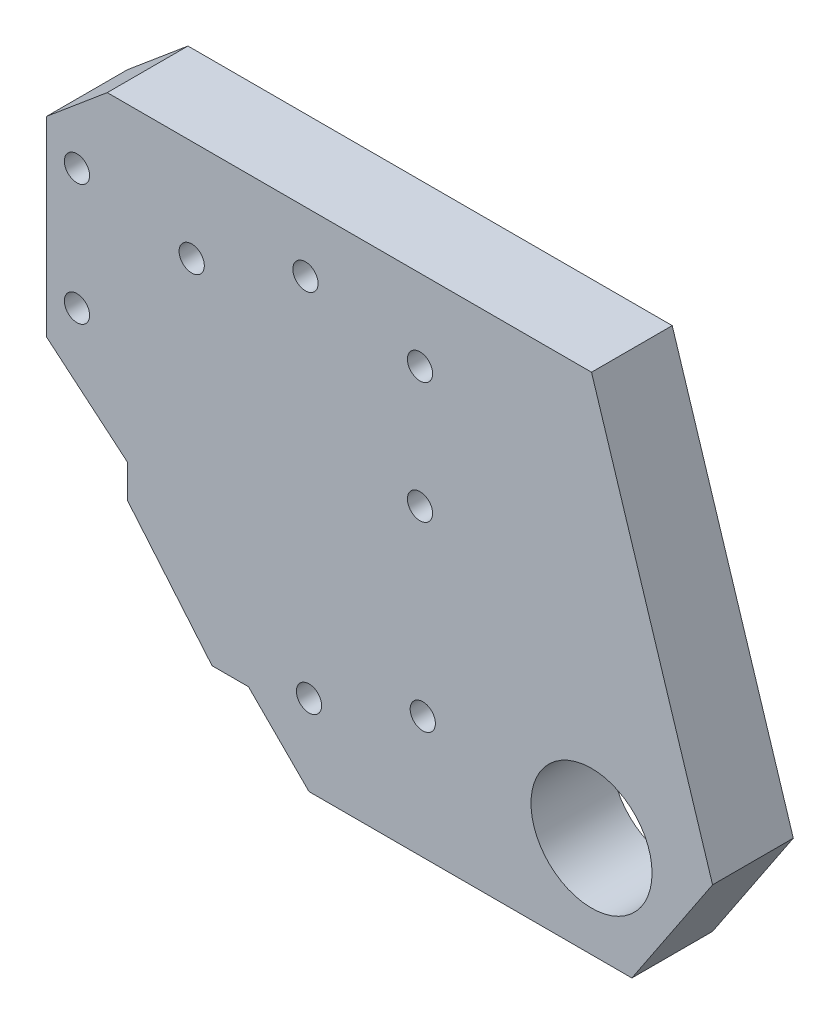
ISO-10303-21;
HEADER;
FILE_DESCRIPTION(('STEP AP214'),'2;1');
FILE_NAME('part.step','',(''),(''),'','','');
FILE_SCHEMA(('AUTOMOTIVE_DESIGN { 1 0 10303 214 1 1 1 1 }'));
ENDSEC;
DATA;
#1=APPLICATION_CONTEXT('core data for automotive mechanical design processes');
#2=APPLICATION_PROTOCOL_DEFINITION('international standard','automotive_design',2000,#1);
#3=PRODUCT_CONTEXT('',#1,'mechanical');
#4=PRODUCT('Part','Part','',(#3));
#5=PRODUCT_RELATED_PRODUCT_CATEGORY('part','',(#4));
#6=PRODUCT_DEFINITION_FORMATION('','',#4);
#7=PRODUCT_DEFINITION_CONTEXT('part definition',#1,'design');
#8=PRODUCT_DEFINITION('design','',#6,#7);
#9=PRODUCT_DEFINITION_SHAPE('','',#8);
#10=(LENGTH_UNIT() NAMED_UNIT(*) SI_UNIT(.MILLI.,.METRE.));
#11=(NAMED_UNIT(*) PLANE_ANGLE_UNIT() SI_UNIT($,.RADIAN.));
#12=(NAMED_UNIT(*) SI_UNIT($,.STERADIAN.) SOLID_ANGLE_UNIT());
#13=UNCERTAINTY_MEASURE_WITH_UNIT(LENGTH_MEASURE(1.E-05),#10,'distance_accuracy_value','');
#14=(GEOMETRIC_REPRESENTATION_CONTEXT(3) GLOBAL_UNCERTAINTY_ASSIGNED_CONTEXT((#13)) GLOBAL_UNIT_ASSIGNED_CONTEXT((#10,
#11,#12)) REPRESENTATION_CONTEXT('',''));
#15=CARTESIAN_POINT('',(0.,0.,0.));
#16=DIRECTION('',(0.,0.,1.));
#17=DIRECTION('',(1.,0.,0.));
#18=AXIS2_PLACEMENT_3D('',#15,#16,#17);
#19=CARTESIAN_POINT('',(0.,0.,4.));
#20=DIRECTION('',(0.,0.,1.));
#21=DIRECTION('',(1.,0.,0.));
#22=AXIS2_PLACEMENT_3D('',#19,#20,#21);
#23=PLANE('',#22);
#24=CARTESIAN_POINT('',(8.82381328817901,22.0268954133145,4.));
#25=DIRECTION('',(0.,0.,1.));
#26=DIRECTION('',(1.,0.,0.));
#27=AXIS2_PLACEMENT_3D('',#24,#25,#26);
#28=CIRCLE('',#27,0.624999999999999);
#29=CARTESIAN_POINT('',(9.44881328817901,22.0268954133145,4.));
#30=VERTEX_POINT('',#29);
#31=EDGE_CURVE('E169',#30,#30,#28,.T.);
#32=ORIENTED_EDGE('',*,*,#31,.F.);
#33=EDGE_LOOP('',(#32));
#34=FACE_BOUND('',#33,.T.);
#35=CARTESIAN_POINT('',(14.6381557247154,6.05212085995405,4.));
#36=DIRECTION('',(0.,0.,1.));
#37=DIRECTION('',(1.,0.,0.));
#38=AXIS2_PLACEMENT_3D('',#35,#36,#37);
#39=CIRCLE('',#38,0.624999999999999);
#40=CARTESIAN_POINT('',(15.2631557247154,6.05212085995405,4.));
#41=VERTEX_POINT('',#40);
#42=EDGE_CURVE('E168',#41,#41,#39,.T.);
#43=ORIENTED_EDGE('',*,*,#42,.F.);
#44=EDGE_LOOP('',(#43));
#45=FACE_BOUND('',#44,.T.);
#46=CARTESIAN_POINT('',(9.,4.,4.));
#47=DIRECTION('',(0.,0.,1.));
#48=DIRECTION('',(1.,0.,0.));
#49=AXIS2_PLACEMENT_3D('',#46,#47,#48);
#50=CIRCLE('',#49,0.624999999999999);
#51=CARTESIAN_POINT('',(9.625,4.,4.));
#52=VERTEX_POINT('',#51);
#53=EDGE_CURVE('E173',#52,#52,#50,.T.);
#54=ORIENTED_EDGE('',*,*,#53,.F.);
#55=EDGE_LOOP('',(#54));
#56=FACE_BOUND('',#55,.T.);
#57=CARTESIAN_POINT('',(3.18565756346356,19.9747745533604,4.));
#58=DIRECTION('',(0.,0.,1.));
#59=DIRECTION('',(1.,0.,0.));
#60=AXIS2_PLACEMENT_3D('',#57,#58,#59);
#61=CIRCLE('',#60,0.624999999999998);
#62=CARTESIAN_POINT('',(3.81065756346356,19.9747745533604,4.));
#63=VERTEX_POINT('',#62);
#64=EDGE_CURVE('E177',#63,#63,#61,.T.);
#65=ORIENTED_EDGE('',*,*,#64,.F.);
#66=EDGE_LOOP('',(#65));
#67=FACE_BOUND('',#66,.T.);
#68=CARTESIAN_POINT('',(-2.5,21.,4.));
#69=DIRECTION('',(0.,0.,1.));
#70=DIRECTION('',(1.,0.,0.));
#71=AXIS2_PLACEMENT_3D('',#68,#69,#70);
#72=CIRCLE('',#71,0.624999999999998);
#73=CARTESIAN_POINT('',(-1.875,21.,4.));
#74=VERTEX_POINT('',#73);
#75=EDGE_CURVE('E181',#74,#74,#72,.T.);
#76=ORIENTED_EDGE('',*,*,#75,.F.);
#77=EDGE_LOOP('',(#76));
#78=FACE_BOUND('',#77,.T.);
#79=CARTESIAN_POINT('',(14.5,21.,4.));
#80=DIRECTION('',(0.,0.,1.));
#81=DIRECTION('',(1.,0.,0.));
#82=AXIS2_PLACEMENT_3D('',#79,#80,#81);
#83=CIRCLE('',#82,0.624999999999999);
#84=CARTESIAN_POINT('',(15.125,21.,4.));
#85=VERTEX_POINT('',#84);
#86=EDGE_CURVE('E185',#85,#85,#83,.T.);
#87=ORIENTED_EDGE('',*,*,#86,.F.);
#88=EDGE_LOOP('',(#87));
#89=FACE_BOUND('',#88,.T.);
#90=CARTESIAN_POINT('',(14.5,15.,4.));
#91=DIRECTION('',(0.,0.,1.));
#92=DIRECTION('',(1.,0.,0.));
#93=AXIS2_PLACEMENT_3D('',#90,#91,#92);
#94=CIRCLE('',#93,0.624999999999999);
#95=CARTESIAN_POINT('',(15.125,15.,4.));
#96=VERTEX_POINT('',#95);
#97=EDGE_CURVE('E189',#96,#96,#94,.T.);
#98=ORIENTED_EDGE('',*,*,#97,.F.);
#99=EDGE_LOOP('',(#98));
#100=FACE_BOUND('',#99,.T.);
#101=CARTESIAN_POINT('',(-2.5,15.,4.));
#102=DIRECTION('',(0.,0.,1.));
#103=DIRECTION('',(1.,0.,0.));
#104=AXIS2_PLACEMENT_3D('',#101,#102,#103);
#105=CIRCLE('',#104,0.624999999999998);
#106=CARTESIAN_POINT('',(-1.875,15.,4.));
#107=VERTEX_POINT('',#106);
#108=EDGE_CURVE('E193',#107,#107,#105,.T.);
#109=ORIENTED_EDGE('',*,*,#108,.F.);
#110=EDGE_LOOP('',(#109));
#111=FACE_BOUND('',#110,.T.);
#112=DIRECTION('',(-1.,0.,0.));
#113=VECTOR('',#112,1.);
#114=CARTESIAN_POINT('',(23.,25.,4.));
#115=LINE('',#114,#113);
#116=CARTESIAN_POINT('',(23.,25.,4.));
#117=VERTEX_POINT('',#116);
#118=CARTESIAN_POINT('',(-0.999999999999973,25.,4.));
#119=VERTEX_POINT('',#118);
#120=EDGE_CURVE('E132',#117,#119,#115,.T.);
#121=ORIENTED_EDGE('',*,*,#120,.T.);
#122=DIRECTION('',(0.76604444311898,0.642787609686537,0.));
#123=VECTOR('',#122,1.);
#124=CARTESIAN_POINT('',(-12.7232728238191,15.1630060973428,4.));
#125=LINE('',#124,#123);
#126=CARTESIAN_POINT('',(-4.,22.4827011064681,4.));
#127=VERTEX_POINT('',#126);
#128=EDGE_CURVE('E11',#119,#127,#125,.F.);
#129=ORIENTED_EDGE('',*,*,#128,.T.);
#130=DIRECTION('',(0.,-1.,0.));
#131=VECTOR('',#130,1.);
#132=CARTESIAN_POINT('',(-4.,25.,4.));
#133=LINE('',#132,#131);
#134=CARTESIAN_POINT('',(-4.,13.,4.));
#135=VERTEX_POINT('',#134);
#136=EDGE_CURVE('E121',#127,#135,#133,.T.);
#137=ORIENTED_EDGE('',*,*,#136,.T.);
#138=DIRECTION('',(-0.766044443118975,0.642787609686543,0.));
#139=VECTOR('',#138,1.);
#140=CARTESIAN_POINT('',(0.,9.64360147529085,4.));
#141=LINE('',#140,#139);
#142=CARTESIAN_POINT('',(0.,9.64360147529085,4.));
#143=VERTEX_POINT('',#142);
#144=EDGE_CURVE('E125',#135,#143,#141,.F.);
#145=ORIENTED_EDGE('',*,*,#144,.T.);
#146=DIRECTION('',(0.,-1.,0.));
#147=VECTOR('',#146,1.);
#148=CARTESIAN_POINT('',(0.,3.,4.));
#149=LINE('',#148,#147);
#150=CARTESIAN_POINT('',(0.,8.00000000000002,4.));
#151=VERTEX_POINT('',#150);
#152=EDGE_CURVE('E131',#143,#151,#149,.T.);
#153=ORIENTED_EDGE('',*,*,#152,.T.);
#154=DIRECTION('',(-0.642787609686538,0.76604444311898,0.));
#155=VECTOR('',#154,1.);
#156=CARTESIAN_POINT('',(3.93923101204884,3.30540728933227,4.));
#157=LINE('',#156,#155);
#158=CARTESIAN_POINT('',(4.1954981558864,3.,4.));
#159=VERTEX_POINT('',#158);
#160=EDGE_CURVE('E155',#151,#159,#157,.F.);
#161=ORIENTED_EDGE('',*,*,#160,.T.);
#162=DIRECTION('',(1.,0.,0.));
#163=VECTOR('',#162,1.);
#164=CARTESIAN_POINT('',(0.,3.,4.));
#165=LINE('',#164,#163);
#166=CARTESIAN_POINT('',(6.,3.,4.));
#167=VERTEX_POINT('',#166);
#168=EDGE_CURVE('E236',#159,#167,#165,.T.);
#169=ORIENTED_EDGE('',*,*,#168,.T.);
#170=DIRECTION('',(0.707106781186556,-0.707106781186539,0.));
#171=VECTOR('',#170,1.);
#172=CARTESIAN_POINT('',(6.,3.,4.));
#173=LINE('',#172,#171);
#174=CARTESIAN_POINT('',(9.00000000000007,0.,4.));
#175=VERTEX_POINT('',#174);
#176=EDGE_CURVE('E234',#167,#175,#173,.T.);
#177=ORIENTED_EDGE('',*,*,#176,.T.);
#178=DIRECTION('',(1.,0.,0.));
#179=VECTOR('',#178,1.);
#180=CARTESIAN_POINT('',(25.,0.,4.));
#181=LINE('',#180,#179);
#182=CARTESIAN_POINT('',(25.,0.,4.));
#183=VERTEX_POINT('',#182);
#184=EDGE_CURVE('E232',#175,#183,#181,.T.);
#185=ORIENTED_EDGE('',*,*,#184,.T.);
#186=DIRECTION('',(0.554700196225229,0.832050294337844,0.));
#187=VECTOR('',#186,1.);
#188=CARTESIAN_POINT('',(29.,6.,4.));
#189=LINE('',#188,#187);
#190=CARTESIAN_POINT('',(29.,6.,4.));
#191=VERTEX_POINT('',#190);
#192=EDGE_CURVE('E230',#183,#191,#189,.T.);
#193=ORIENTED_EDGE('',*,*,#192,.T.);
#194=DIRECTION('',(-0.301131367937098,0.953582665134141,0.));
#195=VECTOR('',#194,1.);
#196=CARTESIAN_POINT('',(23.,25.,4.));
#197=LINE('',#196,#195);
#198=EDGE_CURVE('E212',#191,#117,#197,.T.);
#199=ORIENTED_EDGE('',*,*,#198,.T.);
#200=EDGE_LOOP('',(#121,#129,#137,#145,#153,#161,#169,#177,#185,#193,#199));
#201=FACE_BOUND('',#200,.T.);
#202=CARTESIAN_POINT('',(23.,5.,4.));
#203=DIRECTION('',(0.,0.,1.));
#204=DIRECTION('',(1.,0.,0.));
#205=AXIS2_PLACEMENT_3D('',#202,#203,#204);
#206=CIRCLE('',#205,3.);
#207=CARTESIAN_POINT('',(26.,5.,4.));
#208=VERTEX_POINT('',#207);
#209=EDGE_CURVE('E228',#208,#208,#206,.T.);
#210=ORIENTED_EDGE('',*,*,#209,.F.);
#211=EDGE_LOOP('',(#210));
#212=FACE_BOUND('',#211,.T.);
#213=ADVANCED_FACE('F39',(#34,#45,#56,#67,#78,#89,#100,#111,#201,#212),#23,.T.);
#214=CARTESIAN_POINT('',(0.,0.,0.));
#215=DIRECTION('',(0.,0.,1.));
#216=DIRECTION('',(1.,0.,0.));
#217=AXIS2_PLACEMENT_3D('',#214,#215,#216);
#218=PLANE('',#217);
#219=CARTESIAN_POINT('',(8.82381328817901,22.0268954133145,0.));
#220=DIRECTION('',(0.,0.,1.));
#221=DIRECTION('',(1.,0.,0.));
#222=AXIS2_PLACEMENT_3D('',#219,#220,#221);
#223=CIRCLE('',#222,0.624999999999998);
#224=CARTESIAN_POINT('',(9.44881328817901,22.0268954133145,0.));
#225=VERTEX_POINT('',#224);
#226=EDGE_CURVE('E165',#225,#225,#223,.T.);
#227=ORIENTED_EDGE('',*,*,#226,.T.);
#228=EDGE_LOOP('',(#227));
#229=FACE_BOUND('',#228,.T.);
#230=CARTESIAN_POINT('',(14.6381557247154,6.05212085995405,0.));
#231=DIRECTION('',(0.,0.,1.));
#232=DIRECTION('',(1.,0.,0.));
#233=AXIS2_PLACEMENT_3D('',#230,#231,#232);
#234=CIRCLE('',#233,0.624999999999998);
#235=CARTESIAN_POINT('',(15.2631557247154,6.05212085995405,0.));
#236=VERTEX_POINT('',#235);
#237=EDGE_CURVE('E170',#236,#236,#234,.T.);
#238=ORIENTED_EDGE('',*,*,#237,.T.);
#239=EDGE_LOOP('',(#238));
#240=FACE_BOUND('',#239,.T.);
#241=CARTESIAN_POINT('',(9.,4.,0.));
#242=DIRECTION('',(0.,0.,1.));
#243=DIRECTION('',(1.,0.,0.));
#244=AXIS2_PLACEMENT_3D('',#241,#242,#243);
#245=CIRCLE('',#244,0.624999999999998);
#246=CARTESIAN_POINT('',(9.625,4.,0.));
#247=VERTEX_POINT('',#246);
#248=EDGE_CURVE('E174',#247,#247,#245,.T.);
#249=ORIENTED_EDGE('',*,*,#248,.T.);
#250=EDGE_LOOP('',(#249));
#251=FACE_BOUND('',#250,.T.);
#252=CARTESIAN_POINT('',(3.18565756346356,19.9747745533604,0.));
#253=DIRECTION('',(0.,0.,1.));
#254=DIRECTION('',(1.,0.,0.));
#255=AXIS2_PLACEMENT_3D('',#252,#253,#254);
#256=CIRCLE('',#255,0.624999999999998);
#257=CARTESIAN_POINT('',(3.81065756346356,19.9747745533604,0.));
#258=VERTEX_POINT('',#257);
#259=EDGE_CURVE('E178',#258,#258,#256,.T.);
#260=ORIENTED_EDGE('',*,*,#259,.T.);
#261=EDGE_LOOP('',(#260));
#262=FACE_BOUND('',#261,.T.);
#263=CARTESIAN_POINT('',(-2.5,21.,0.));
#264=DIRECTION('',(0.,0.,1.));
#265=DIRECTION('',(1.,0.,0.));
#266=AXIS2_PLACEMENT_3D('',#263,#264,#265);
#267=CIRCLE('',#266,0.624999999999998);
#268=CARTESIAN_POINT('',(-1.875,21.,0.));
#269=VERTEX_POINT('',#268);
#270=EDGE_CURVE('E182',#269,#269,#267,.T.);
#271=ORIENTED_EDGE('',*,*,#270,.T.);
#272=EDGE_LOOP('',(#271));
#273=FACE_BOUND('',#272,.T.);
#274=CARTESIAN_POINT('',(14.5,21.,0.));
#275=DIRECTION('',(0.,0.,1.));
#276=DIRECTION('',(1.,0.,0.));
#277=AXIS2_PLACEMENT_3D('',#274,#275,#276);
#278=CIRCLE('',#277,0.624999999999998);
#279=CARTESIAN_POINT('',(15.125,21.,0.));
#280=VERTEX_POINT('',#279);
#281=EDGE_CURVE('E186',#280,#280,#278,.T.);
#282=ORIENTED_EDGE('',*,*,#281,.T.);
#283=EDGE_LOOP('',(#282));
#284=FACE_BOUND('',#283,.T.);
#285=CARTESIAN_POINT('',(14.5,15.,0.));
#286=DIRECTION('',(0.,0.,1.));
#287=DIRECTION('',(1.,0.,0.));
#288=AXIS2_PLACEMENT_3D('',#285,#286,#287);
#289=CIRCLE('',#288,0.624999999999998);
#290=CARTESIAN_POINT('',(15.125,15.,0.));
#291=VERTEX_POINT('',#290);
#292=EDGE_CURVE('E190',#291,#291,#289,.T.);
#293=ORIENTED_EDGE('',*,*,#292,.T.);
#294=EDGE_LOOP('',(#293));
#295=FACE_BOUND('',#294,.T.);
#296=CARTESIAN_POINT('',(-2.5,15.,0.));
#297=DIRECTION('',(0.,0.,1.));
#298=DIRECTION('',(1.,0.,0.));
#299=AXIS2_PLACEMENT_3D('',#296,#297,#298);
#300=CIRCLE('',#299,0.624999999999998);
#301=CARTESIAN_POINT('',(-1.875,15.,0.));
#302=VERTEX_POINT('',#301);
#303=EDGE_CURVE('E194',#302,#302,#300,.T.);
#304=ORIENTED_EDGE('',*,*,#303,.T.);
#305=EDGE_LOOP('',(#304));
#306=FACE_BOUND('',#305,.T.);
#307=DIRECTION('',(0.,-1.,0.));
#308=VECTOR('',#307,1.);
#309=CARTESIAN_POINT('',(-4.,25.,0.));
#310=LINE('',#309,#308);
#311=CARTESIAN_POINT('',(-4.,22.4827011064681,0.));
#312=VERTEX_POINT('',#311);
#313=CARTESIAN_POINT('',(-4.,13.,0.));
#314=VERTEX_POINT('',#313);
#315=EDGE_CURVE('E137',#312,#314,#310,.T.);
#316=ORIENTED_EDGE('',*,*,#315,.F.);
#317=DIRECTION('',(-0.76604444311898,-0.642787609686537,0.));
#318=VECTOR('',#317,1.);
#319=CARTESIAN_POINT('',(-4.,22.4827011064681,0.));
#320=LINE('',#319,#318);
#321=CARTESIAN_POINT('',(-0.999999999999977,25.,0.));
#322=VERTEX_POINT('',#321);
#323=EDGE_CURVE('E61',#312,#322,#320,.F.);
#324=ORIENTED_EDGE('',*,*,#323,.T.);
#325=DIRECTION('',(-1.,0.,0.));
#326=VECTOR('',#325,1.);
#327=CARTESIAN_POINT('',(23.,25.,0.));
#328=LINE('',#327,#326);
#329=CARTESIAN_POINT('',(23.,25.,0.));
#330=VERTEX_POINT('',#329);
#331=EDGE_CURVE('E226',#330,#322,#328,.T.);
#332=ORIENTED_EDGE('',*,*,#331,.F.);
#333=DIRECTION('',(-0.301131367937098,0.953582665134141,0.));
#334=VECTOR('',#333,1.);
#335=CARTESIAN_POINT('',(23.,25.,0.));
#336=LINE('',#335,#334);
#337=CARTESIAN_POINT('',(29.,6.,0.));
#338=VERTEX_POINT('',#337);
#339=EDGE_CURVE('E213',#338,#330,#336,.T.);
#340=ORIENTED_EDGE('',*,*,#339,.F.);
#341=DIRECTION('',(0.554700196225229,0.832050294337844,0.));
#342=VECTOR('',#341,1.);
#343=CARTESIAN_POINT('',(29.,6.,0.));
#344=LINE('',#343,#342);
#345=CARTESIAN_POINT('',(25.,0.,0.));
#346=VERTEX_POINT('',#345);
#347=EDGE_CURVE('E215',#346,#338,#344,.T.);
#348=ORIENTED_EDGE('',*,*,#347,.F.);
#349=DIRECTION('',(1.,0.,0.));
#350=VECTOR('',#349,1.);
#351=CARTESIAN_POINT('',(25.,0.,0.));
#352=LINE('',#351,#350);
#353=CARTESIAN_POINT('',(9.00000000000007,0.,0.));
#354=VERTEX_POINT('',#353);
#355=EDGE_CURVE('E217',#354,#346,#352,.T.);
#356=ORIENTED_EDGE('',*,*,#355,.F.);
#357=DIRECTION('',(0.707106781186556,-0.707106781186539,0.));
#358=VECTOR('',#357,1.);
#359=CARTESIAN_POINT('',(6.,3.,0.));
#360=LINE('',#359,#358);
#361=CARTESIAN_POINT('',(6.,3.,0.));
#362=VERTEX_POINT('',#361);
#363=EDGE_CURVE('E219',#362,#354,#360,.T.);
#364=ORIENTED_EDGE('',*,*,#363,.F.);
#365=DIRECTION('',(1.,0.,0.));
#366=VECTOR('',#365,1.);
#367=CARTESIAN_POINT('',(0.,3.,0.));
#368=LINE('',#367,#366);
#369=CARTESIAN_POINT('',(4.1954981558864,3.,0.));
#370=VERTEX_POINT('',#369);
#371=EDGE_CURVE('E221',#370,#362,#368,.T.);
#372=ORIENTED_EDGE('',*,*,#371,.F.);
#373=DIRECTION('',(0.642787609686538,-0.76604444311898,0.));
#374=VECTOR('',#373,1.);
#375=CARTESIAN_POINT('',(4.1954981558864,3.,0.));
#376=LINE('',#375,#374);
#377=CARTESIAN_POINT('',(0.,8.00000000000002,0.));
#378=VERTEX_POINT('',#377);
#379=EDGE_CURVE('E160',#370,#378,#376,.F.);
#380=ORIENTED_EDGE('',*,*,#379,.T.);
#381=DIRECTION('',(0.,-1.,0.));
#382=VECTOR('',#381,1.);
#383=CARTESIAN_POINT('',(0.,3.,0.));
#384=LINE('',#383,#382);
#385=CARTESIAN_POINT('',(0.,9.64360147529085,0.));
#386=VERTEX_POINT('',#385);
#387=EDGE_CURVE('E223',#386,#378,#384,.T.);
#388=ORIENTED_EDGE('',*,*,#387,.F.);
#389=DIRECTION('',(0.766044443118975,-0.642787609686543,0.));
#390=VECTOR('',#389,1.);
#391=CARTESIAN_POINT('',(4.7485467499132,5.65909764881057,0.));
#392=LINE('',#391,#390);
#393=EDGE_CURVE('E148',#386,#314,#392,.F.);
#394=ORIENTED_EDGE('',*,*,#393,.T.);
#395=EDGE_LOOP('',(#316,#324,#332,#340,#348,#356,#364,#372,#380,#388,#394));
#396=FACE_BOUND('',#395,.T.);
#397=CARTESIAN_POINT('',(23.,5.,0.));
#398=DIRECTION('',(0.,0.,1.));
#399=DIRECTION('',(1.,0.,0.));
#400=AXIS2_PLACEMENT_3D('',#397,#398,#399);
#401=CIRCLE('',#400,3.);
#402=CARTESIAN_POINT('',(26.,5.,0.));
#403=VERTEX_POINT('',#402);
#404=EDGE_CURVE('E196',#403,#403,#401,.T.);
#405=ORIENTED_EDGE('',*,*,#404,.T.);
#406=EDGE_LOOP('',(#405));
#407=FACE_BOUND('',#406,.T.);
#408=ADVANCED_FACE('F266',(#229,#240,#251,#262,#273,#284,#295,#306,#396,#407),#218,.F.);
#409=CARTESIAN_POINT('',(23.,25.,4.));
#410=DIRECTION('',(0.,-1.,0.));
#411=DIRECTION('',(0.,0.,-1.));
#412=AXIS2_PLACEMENT_3D('',#409,#410,#411);
#413=PLANE('',#412);
#414=ORIENTED_EDGE('',*,*,#331,.T.);
#415=DIRECTION('',(0.,0.,1.));
#416=VECTOR('',#415,1.);
#417=CARTESIAN_POINT('',(-0.999999999999977,25.,4.));
#418=LINE('',#417,#416);
#419=EDGE_CURVE('E47',#322,#119,#418,.T.);
#420=ORIENTED_EDGE('',*,*,#419,.T.);
#421=ORIENTED_EDGE('',*,*,#120,.F.);
#422=DIRECTION('',(0.,0.,-1.));
#423=VECTOR('',#422,1.);
#424=CARTESIAN_POINT('',(23.,25.,4.));
#425=LINE('',#424,#423);
#426=EDGE_CURVE('E209',#117,#330,#425,.T.);
#427=ORIENTED_EDGE('',*,*,#426,.T.);
#428=EDGE_LOOP('',(#414,#420,#421,#427));
#429=FACE_BOUND('',#428,.T.);
#430=ADVANCED_FACE('F291',(#429),#413,.F.);
#431=CARTESIAN_POINT('',(-4.,25.,4.));
#432=DIRECTION('',(1.,0.,0.));
#433=DIRECTION('',(0.,1.,0.));
#434=AXIS2_PLACEMENT_3D('',#431,#432,#433);
#435=PLANE('',#434);
#436=ORIENTED_EDGE('',*,*,#136,.F.);
#437=DIRECTION('',(0.,0.,-1.));
#438=VECTOR('',#437,1.);
#439=CARTESIAN_POINT('',(-4.,22.4827011064681,4.));
#440=LINE('',#439,#438);
#441=EDGE_CURVE('E147',#127,#312,#440,.T.);
#442=ORIENTED_EDGE('',*,*,#441,.T.);
#443=ORIENTED_EDGE('',*,*,#315,.T.);
#444=DIRECTION('',(0.,0.,-1.));
#445=VECTOR('',#444,1.);
#446=CARTESIAN_POINT('',(-4.,13.,4.));
#447=LINE('',#446,#445);
#448=EDGE_CURVE('E135',#135,#314,#447,.T.);
#449=ORIENTED_EDGE('',*,*,#448,.F.);
#450=EDGE_LOOP('',(#436,#442,#443,#449));
#451=FACE_BOUND('',#450,.T.);
#452=ADVANCED_FACE('F136',(#451),#435,.F.);
#453=CARTESIAN_POINT('',(0.,3.,4.));
#454=DIRECTION('',(1.,0.,0.));
#455=DIRECTION('',(0.,0.,-1.));
#456=AXIS2_PLACEMENT_3D('',#453,#454,#455);
#457=PLANE('',#456);
#458=ORIENTED_EDGE('',*,*,#152,.F.);
#459=DIRECTION('',(0.,0.,-1.));
#460=VECTOR('',#459,1.);
#461=CARTESIAN_POINT('',(0.,9.64360147529085,0.));
#462=LINE('',#461,#460);
#463=EDGE_CURVE('E146',#143,#386,#462,.T.);
#464=ORIENTED_EDGE('',*,*,#463,.T.);
#465=ORIENTED_EDGE('',*,*,#387,.T.);
#466=DIRECTION('',(0.,0.,1.));
#467=VECTOR('',#466,1.);
#468=CARTESIAN_POINT('',(0.,8.00000000000002,4.));
#469=LINE('',#468,#467);
#470=EDGE_CURVE('E157',#378,#151,#469,.T.);
#471=ORIENTED_EDGE('',*,*,#470,.T.);
#472=EDGE_LOOP('',(#458,#464,#465,#471));
#473=FACE_BOUND('',#472,.T.);
#474=ADVANCED_FACE('F323',(#473),#457,.F.);
#475=CARTESIAN_POINT('',(0.,3.,4.));
#476=DIRECTION('',(0.,1.,0.));
#477=DIRECTION('',(-1.,0.,0.));
#478=AXIS2_PLACEMENT_3D('',#475,#476,#477);
#479=PLANE('',#478);
#480=ORIENTED_EDGE('',*,*,#168,.F.);
#481=DIRECTION('',(0.,0.,-1.));
#482=VECTOR('',#481,1.);
#483=CARTESIAN_POINT('',(4.1954981558864,3.,4.));
#484=LINE('',#483,#482);
#485=EDGE_CURVE('E140',#159,#370,#484,.T.);
#486=ORIENTED_EDGE('',*,*,#485,.T.);
#487=ORIENTED_EDGE('',*,*,#371,.T.);
#488=DIRECTION('',(0.,0.,-1.));
#489=VECTOR('',#488,1.);
#490=CARTESIAN_POINT('',(6.,3.,4.));
#491=LINE('',#490,#489);
#492=EDGE_CURVE('E141',#167,#362,#491,.T.);
#493=ORIENTED_EDGE('',*,*,#492,.F.);
#494=EDGE_LOOP('',(#480,#486,#487,#493));
#495=FACE_BOUND('',#494,.T.);
#496=ADVANCED_FACE('F319',(#495),#479,.F.);
#497=CARTESIAN_POINT('',(6.,3.,4.));
#498=DIRECTION('',(0.707106781186539,0.707106781186556,0.));
#499=DIRECTION('',(-0.707106781186556,0.707106781186539,0.));
#500=AXIS2_PLACEMENT_3D('',#497,#498,#499);
#501=PLANE('',#500);
#502=ORIENTED_EDGE('',*,*,#363,.T.);
#503=DIRECTION('',(0.,0.,-1.));
#504=VECTOR('',#503,1.);
#505=CARTESIAN_POINT('',(9.00000000000007,0.,4.));
#506=LINE('',#505,#504);
#507=EDGE_CURVE('E200',#175,#354,#506,.T.);
#508=ORIENTED_EDGE('',*,*,#507,.F.);
#509=ORIENTED_EDGE('',*,*,#176,.F.);
#510=ORIENTED_EDGE('',*,*,#492,.T.);
#511=EDGE_LOOP('',(#502,#508,#509,#510));
#512=FACE_BOUND('',#511,.T.);
#513=ADVANCED_FACE('F315',(#512),#501,.F.);
#514=CARTESIAN_POINT('',(25.,0.,4.));
#515=DIRECTION('',(0.,1.,0.));
#516=DIRECTION('',(-1.,0.,0.));
#517=AXIS2_PLACEMENT_3D('',#514,#515,#516);
#518=PLANE('',#517);
#519=ORIENTED_EDGE('',*,*,#355,.T.);
#520=DIRECTION('',(0.,0.,-1.));
#521=VECTOR('',#520,1.);
#522=CARTESIAN_POINT('',(25.,0.,4.));
#523=LINE('',#522,#521);
#524=EDGE_CURVE('E203',#183,#346,#523,.T.);
#525=ORIENTED_EDGE('',*,*,#524,.F.);
#526=ORIENTED_EDGE('',*,*,#184,.F.);
#527=ORIENTED_EDGE('',*,*,#507,.T.);
#528=EDGE_LOOP('',(#519,#525,#526,#527));
#529=FACE_BOUND('',#528,.T.);
#530=ADVANCED_FACE('F311',(#529),#518,.F.);
#531=CARTESIAN_POINT('',(29.,6.,4.));
#532=DIRECTION('',(-0.832050294337844,0.554700196225229,0.));
#533=DIRECTION('',(-0.554700196225229,-0.832050294337844,0.));
#534=AXIS2_PLACEMENT_3D('',#531,#532,#533);
#535=PLANE('',#534);
#536=ORIENTED_EDGE('',*,*,#347,.T.);
#537=DIRECTION('',(0.,0.,-1.));
#538=VECTOR('',#537,1.);
#539=CARTESIAN_POINT('',(29.,6.,4.));
#540=LINE('',#539,#538);
#541=EDGE_CURVE('E206',#191,#338,#540,.T.);
#542=ORIENTED_EDGE('',*,*,#541,.F.);
#543=ORIENTED_EDGE('',*,*,#192,.F.);
#544=ORIENTED_EDGE('',*,*,#524,.T.);
#545=EDGE_LOOP('',(#536,#542,#543,#544));
#546=FACE_BOUND('',#545,.T.);
#547=ADVANCED_FACE('F304',(#546),#535,.F.);
#548=CARTESIAN_POINT('',(23.,25.,4.));
#549=DIRECTION('',(-0.953582665134142,-0.301131367937098,0.));
#550=DIRECTION('',(0.301131367937098,-0.953582665134141,0.));
#551=AXIS2_PLACEMENT_3D('',#548,#549,#550);
#552=PLANE('',#551);
#553=ORIENTED_EDGE('',*,*,#339,.T.);
#554=ORIENTED_EDGE('',*,*,#426,.F.);
#555=ORIENTED_EDGE('',*,*,#198,.F.);
#556=ORIENTED_EDGE('',*,*,#541,.T.);
#557=EDGE_LOOP('',(#553,#554,#555,#556));
#558=FACE_BOUND('',#557,.T.);
#559=ADVANCED_FACE('F298',(#558),#552,.F.);
#560=CARTESIAN_POINT('',(23.,5.,4.));
#561=DIRECTION('',(0.,0.,-1.));
#562=DIRECTION('',(-1.,0.,0.));
#563=AXIS2_PLACEMENT_3D('',#560,#561,#562);
#564=CYLINDRICAL_SURFACE('',#563,3.);
#565=ORIENTED_EDGE('',*,*,#209,.T.);
#566=EDGE_LOOP('',(#565));
#567=FACE_BOUND('',#566,.T.);
#568=ORIENTED_EDGE('',*,*,#404,.F.);
#569=EDGE_LOOP('',(#568));
#570=FACE_BOUND('',#569,.T.);
#571=ADVANCED_FACE('F286',(#567,#570),#564,.F.);
#572=CARTESIAN_POINT('',(-2.5,15.,4.));
#573=DIRECTION('',(0.,0.,1.));
#574=DIRECTION('',(1.,0.,0.));
#575=AXIS2_PLACEMENT_3D('',#572,#573,#574);
#576=CYLINDRICAL_SURFACE('',#575,0.624999999999998);
#577=ORIENTED_EDGE('',*,*,#108,.T.);
#578=EDGE_LOOP('',(#577));
#579=FACE_BOUND('',#578,.T.);
#580=ORIENTED_EDGE('',*,*,#303,.F.);
#581=EDGE_LOOP('',(#580));
#582=FACE_BOUND('',#581,.T.);
#583=ADVANCED_FACE('F282',(#579,#582),#576,.F.);
#584=CARTESIAN_POINT('',(14.5,15.,4.));
#585=DIRECTION('',(0.,0.,1.));
#586=DIRECTION('',(1.,0.,0.));
#587=AXIS2_PLACEMENT_3D('',#584,#585,#586);
#588=CYLINDRICAL_SURFACE('',#587,0.624999999999998);
#589=ORIENTED_EDGE('',*,*,#97,.T.);
#590=EDGE_LOOP('',(#589));
#591=FACE_BOUND('',#590,.T.);
#592=ORIENTED_EDGE('',*,*,#292,.F.);
#593=EDGE_LOOP('',(#592));
#594=FACE_BOUND('',#593,.T.);
#595=ADVANCED_FACE('F285',(#591,#594),#588,.F.);
#596=CARTESIAN_POINT('',(14.5,21.,4.));
#597=DIRECTION('',(0.,0.,1.));
#598=DIRECTION('',(1.,0.,0.));
#599=AXIS2_PLACEMENT_3D('',#596,#597,#598);
#600=CYLINDRICAL_SURFACE('',#599,0.624999999999998);
#601=ORIENTED_EDGE('',*,*,#86,.T.);
#602=EDGE_LOOP('',(#601));
#603=FACE_BOUND('',#602,.T.);
#604=ORIENTED_EDGE('',*,*,#281,.F.);
#605=EDGE_LOOP('',(#604));
#606=FACE_BOUND('',#605,.T.);
#607=ADVANCED_FACE('F443',(#603,#606),#600,.F.);
#608=CARTESIAN_POINT('',(-2.5,21.,4.));
#609=DIRECTION('',(0.,0.,1.));
#610=DIRECTION('',(1.,0.,0.));
#611=AXIS2_PLACEMENT_3D('',#608,#609,#610);
#612=CYLINDRICAL_SURFACE('',#611,0.624999999999998);
#613=ORIENTED_EDGE('',*,*,#75,.T.);
#614=EDGE_LOOP('',(#613));
#615=FACE_BOUND('',#614,.T.);
#616=ORIENTED_EDGE('',*,*,#270,.F.);
#617=EDGE_LOOP('',(#616));
#618=FACE_BOUND('',#617,.T.);
#619=ADVANCED_FACE('F432',(#615,#618),#612,.F.);
#620=CARTESIAN_POINT('',(3.18565756346356,19.9747745533604,4.));
#621=DIRECTION('',(0.,0.,1.));
#622=DIRECTION('',(1.,0.,0.));
#623=AXIS2_PLACEMENT_3D('',#620,#621,#622);
#624=CYLINDRICAL_SURFACE('',#623,0.624999999999998);
#625=ORIENTED_EDGE('',*,*,#64,.T.);
#626=EDGE_LOOP('',(#625));
#627=FACE_BOUND('',#626,.T.);
#628=ORIENTED_EDGE('',*,*,#259,.F.);
#629=EDGE_LOOP('',(#628));
#630=FACE_BOUND('',#629,.T.);
#631=ADVANCED_FACE('F421',(#627,#630),#624,.F.);
#632=CARTESIAN_POINT('',(9.,4.,4.));
#633=DIRECTION('',(0.,0.,1.));
#634=DIRECTION('',(1.,0.,0.));
#635=AXIS2_PLACEMENT_3D('',#632,#633,#634);
#636=CYLINDRICAL_SURFACE('',#635,0.624999999999998);
#637=ORIENTED_EDGE('',*,*,#53,.T.);
#638=EDGE_LOOP('',(#637));
#639=FACE_BOUND('',#638,.T.);
#640=ORIENTED_EDGE('',*,*,#248,.F.);
#641=EDGE_LOOP('',(#640));
#642=FACE_BOUND('',#641,.T.);
#643=ADVANCED_FACE('F410',(#639,#642),#636,.F.);
#644=CARTESIAN_POINT('',(14.6381557247154,6.05212085995405,4.));
#645=DIRECTION('',(0.,0.,1.));
#646=DIRECTION('',(1.,0.,0.));
#647=AXIS2_PLACEMENT_3D('',#644,#645,#646);
#648=CYLINDRICAL_SURFACE('',#647,0.624999999999998);
#649=ORIENTED_EDGE('',*,*,#42,.T.);
#650=EDGE_LOOP('',(#649));
#651=FACE_BOUND('',#650,.T.);
#652=ORIENTED_EDGE('',*,*,#237,.F.);
#653=EDGE_LOOP('',(#652));
#654=FACE_BOUND('',#653,.T.);
#655=ADVANCED_FACE('F399',(#651,#654),#648,.F.);
#656=CARTESIAN_POINT('',(8.82381328817901,22.0268954133145,4.));
#657=DIRECTION('',(0.,0.,1.));
#658=DIRECTION('',(1.,0.,0.));
#659=AXIS2_PLACEMENT_3D('',#656,#657,#658);
#660=CYLINDRICAL_SURFACE('',#659,0.624999999999998);
#661=ORIENTED_EDGE('',*,*,#31,.T.);
#662=EDGE_LOOP('',(#661));
#663=FACE_BOUND('',#662,.T.);
#664=ORIENTED_EDGE('',*,*,#226,.F.);
#665=EDGE_LOOP('',(#664));
#666=FACE_BOUND('',#665,.T.);
#667=ADVANCED_FACE('F261',(#663,#666),#660,.F.);
#668=CARTESIAN_POINT('',(4.1954981558864,3.,4.));
#669=DIRECTION('',(0.766044443118979,0.642787609686538,0.));
#670=DIRECTION('',(0.,0.,-1.));
#671=AXIS2_PLACEMENT_3D('',#668,#669,#670);
#672=PLANE('',#671);
#673=ORIENTED_EDGE('',*,*,#160,.F.);
#674=ORIENTED_EDGE('',*,*,#470,.F.);
#675=ORIENTED_EDGE('',*,*,#379,.F.);
#676=ORIENTED_EDGE('',*,*,#485,.F.);
#677=EDGE_LOOP('',(#673,#674,#675,#676));
#678=FACE_BOUND('',#677,.T.);
#679=ADVANCED_FACE('F332',(#678),#672,.F.);
#680=CARTESIAN_POINT('',(0.,9.64360147529085,4.));
#681=DIRECTION('',(-0.642787609686543,-0.766044443118975,0.));
#682=DIRECTION('',(0.,0.,1.));
#683=AXIS2_PLACEMENT_3D('',#680,#681,#682);
#684=PLANE('',#683);
#685=ORIENTED_EDGE('',*,*,#144,.F.);
#686=ORIENTED_EDGE('',*,*,#448,.T.);
#687=ORIENTED_EDGE('',*,*,#393,.F.);
#688=ORIENTED_EDGE('',*,*,#463,.F.);
#689=EDGE_LOOP('',(#685,#686,#687,#688));
#690=FACE_BOUND('',#689,.T.);
#691=ADVANCED_FACE('F144',(#690),#684,.T.);
#692=CARTESIAN_POINT('',(-4.,22.4827011064681,4.));
#693=DIRECTION('',(0.642787609686537,-0.76604444311898,0.));
#694=DIRECTION('',(0.,0.,-1.));
#695=AXIS2_PLACEMENT_3D('',#692,#693,#694);
#696=PLANE('',#695);
#697=ORIENTED_EDGE('',*,*,#128,.F.);
#698=ORIENTED_EDGE('',*,*,#419,.F.);
#699=ORIENTED_EDGE('',*,*,#323,.F.);
#700=ORIENTED_EDGE('',*,*,#441,.F.);
#701=EDGE_LOOP('',(#697,#698,#699,#700));
#702=FACE_BOUND('',#701,.T.);
#703=ADVANCED_FACE('F41',(#702),#696,.F.);
#704=CLOSED_SHELL('',(#213,#408,#430,#452,#474,#496,#513,#530,#547,#559,#571,#583,#595,#607,
#619,#631,#643,#655,#667,#679,#691,#703));
#705=MANIFOLD_SOLID_BREP('B2',#704);
#706=ADVANCED_BREP_SHAPE_REPRESENTATION('',(#18,#705),#14);
#707=SHAPE_DEFINITION_REPRESENTATION(#9,#706);
ENDSEC;
END-ISO-10303-21;
